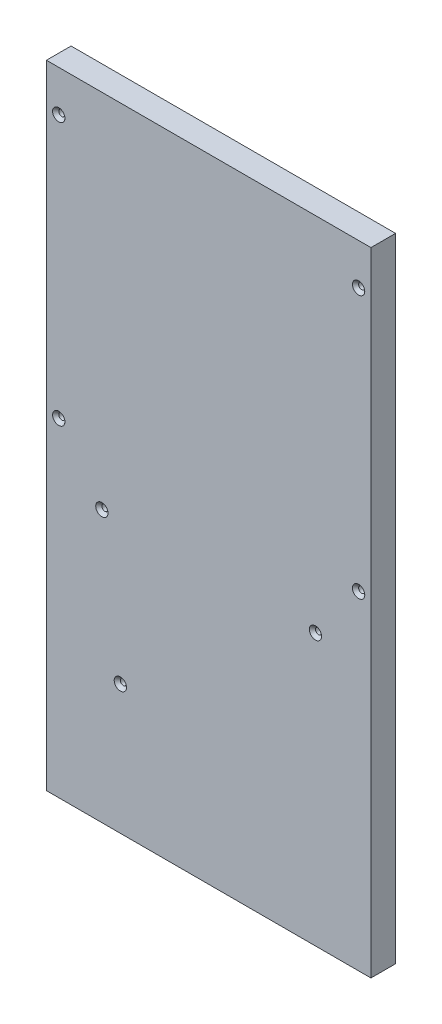
ISO-10303-21;
HEADER;
FILE_DESCRIPTION(('STEP AP214'),'2;1');
FILE_NAME('part.step','',(''),(''),'','','');
FILE_SCHEMA(('AUTOMOTIVE_DESIGN { 1 0 10303 214 1 1 1 1 }'));
ENDSEC;
DATA;
#1=APPLICATION_CONTEXT('core data for automotive mechanical design processes');
#2=APPLICATION_PROTOCOL_DEFINITION('international standard','automotive_design',2000,#1);
#3=PRODUCT_CONTEXT('',#1,'mechanical');
#4=PRODUCT('Part','Part','',(#3));
#5=PRODUCT_RELATED_PRODUCT_CATEGORY('part','',(#4));
#6=PRODUCT_DEFINITION_FORMATION('','',#4);
#7=PRODUCT_DEFINITION_CONTEXT('part definition',#1,'design');
#8=PRODUCT_DEFINITION('design','',#6,#7);
#9=PRODUCT_DEFINITION_SHAPE('','',#8);
#10=(LENGTH_UNIT() NAMED_UNIT(*) SI_UNIT(.MILLI.,.METRE.));
#11=(NAMED_UNIT(*) PLANE_ANGLE_UNIT() SI_UNIT($,.RADIAN.));
#12=(NAMED_UNIT(*) SI_UNIT($,.STERADIAN.) SOLID_ANGLE_UNIT());
#13=UNCERTAINTY_MEASURE_WITH_UNIT(LENGTH_MEASURE(1.E-05),#10,'distance_accuracy_value','');
#14=(GEOMETRIC_REPRESENTATION_CONTEXT(3) GLOBAL_UNCERTAINTY_ASSIGNED_CONTEXT((#13)) GLOBAL_UNIT_ASSIGNED_CONTEXT((#10,
#11,#12)) REPRESENTATION_CONTEXT('',''));
#15=CARTESIAN_POINT('',(0.,0.,0.));
#16=DIRECTION('',(0.,0.,1.));
#17=DIRECTION('',(1.,0.,0.));
#18=AXIS2_PLACEMENT_3D('',#15,#16,#17);
#19=CARTESIAN_POINT('',(0.,0.,12.));
#20=DIRECTION('',(0.,0.,1.));
#21=DIRECTION('',(1.,0.,0.));
#22=AXIS2_PLACEMENT_3D('',#19,#20,#21);
#23=PLANE('',#22);
#24=CARTESIAN_POINT('',(-12.9512195121951,-36.4634146341464,12.));
#25=DIRECTION('',(0.,0.,1.));
#26=DIRECTION('',(1.,0.,0.));
#27=AXIS2_PLACEMENT_3D('',#24,#25,#26);
#28=CIRCLE('',#27,3.);
#29=CARTESIAN_POINT('',(-9.95121951219509,-36.4634146341464,12.));
#30=VERTEX_POINT('',#29);
#31=EDGE_CURVE('E452',#30,#30,#28,.T.);
#32=ORIENTED_EDGE('',*,*,#31,.F.);
#33=EDGE_LOOP('',(#32));
#34=FACE_BOUND('',#33,.T.);
#35=CARTESIAN_POINT('',(-12.9512195121951,91.5365853658536,12.));
#36=DIRECTION('',(0.,0.,1.));
#37=DIRECTION('',(1.,0.,0.));
#38=AXIS2_PLACEMENT_3D('',#35,#36,#37);
#39=CIRCLE('',#38,3.);
#40=CARTESIAN_POINT('',(-9.95121951219511,91.5365853658536,12.));
#41=VERTEX_POINT('',#40);
#42=EDGE_CURVE('E456',#41,#41,#39,.T.);
#43=ORIENTED_EDGE('',*,*,#42,.F.);
#44=EDGE_LOOP('',(#43));
#45=FACE_BOUND('',#44,.T.);
#46=CARTESIAN_POINT('',(-158.951219512195,-36.4634146341464,12.));
#47=DIRECTION('',(0.,0.,1.));
#48=DIRECTION('',(1.,0.,0.));
#49=AXIS2_PLACEMENT_3D('',#46,#47,#48);
#50=CIRCLE('',#49,2.99999999999999);
#51=CARTESIAN_POINT('',(-155.951219512195,-36.4634146341464,12.));
#52=VERTEX_POINT('',#51);
#53=EDGE_CURVE('E461',#52,#52,#50,.T.);
#54=ORIENTED_EDGE('',*,*,#53,.F.);
#55=EDGE_LOOP('',(#54));
#56=FACE_BOUND('',#55,.T.);
#57=CARTESIAN_POINT('',(-158.951219512195,91.5365853658536,12.));
#58=DIRECTION('',(0.,0.,1.));
#59=DIRECTION('',(1.,0.,0.));
#60=AXIS2_PLACEMENT_3D('',#57,#58,#59);
#61=CIRCLE('',#60,2.99999999999999);
#62=CARTESIAN_POINT('',(-155.951219512195,91.5365853658536,12.));
#63=VERTEX_POINT('',#62);
#64=EDGE_CURVE('E139',#63,#63,#61,.T.);
#65=ORIENTED_EDGE('',*,*,#64,.F.);
#66=EDGE_LOOP('',(#65));
#67=FACE_BOUND('',#66,.T.);
#68=CARTESIAN_POINT('',(-128.951219512195,-133.463414634146,12.));
#69=DIRECTION('',(0.,0.,1.));
#70=DIRECTION('',(1.,0.,0.));
#71=AXIS2_PLACEMENT_3D('',#68,#69,#70);
#72=CIRCLE('',#71,2.99999999999999);
#73=CARTESIAN_POINT('',(-125.951219512195,-133.463414634146,12.));
#74=VERTEX_POINT('',#73);
#75=EDGE_CURVE('E467',#74,#74,#72,.T.);
#76=ORIENTED_EDGE('',*,*,#75,.F.);
#77=EDGE_LOOP('',(#76));
#78=FACE_BOUND('',#77,.T.);
#79=CARTESIAN_POINT('',(-33.9512195121951,-64.4634146341464,12.));
#80=DIRECTION('',(0.,0.,1.));
#81=DIRECTION('',(1.,0.,0.));
#82=AXIS2_PLACEMENT_3D('',#79,#80,#81);
#83=CIRCLE('',#82,2.99999999999999);
#84=CARTESIAN_POINT('',(-30.9512195121951,-64.4634146341464,12.));
#85=VERTEX_POINT('',#84);
#86=EDGE_CURVE('E118',#85,#85,#83,.T.);
#87=ORIENTED_EDGE('',*,*,#86,.F.);
#88=EDGE_LOOP('',(#87));
#89=FACE_BOUND('',#88,.T.);
#90=CARTESIAN_POINT('',(-137.951219512195,-64.4634146341464,12.));
#91=DIRECTION('',(0.,0.,1.));
#92=DIRECTION('',(1.,0.,0.));
#93=AXIS2_PLACEMENT_3D('',#90,#91,#92);
#94=CIRCLE('',#93,2.99999999999999);
#95=CARTESIAN_POINT('',(-134.951219512195,-64.4634146341464,12.));
#96=VERTEX_POINT('',#95);
#97=EDGE_CURVE('E113',#96,#96,#94,.T.);
#98=ORIENTED_EDGE('',*,*,#97,.F.);
#99=EDGE_LOOP('',(#98));
#100=FACE_BOUND('',#99,.T.);
#101=DIRECTION('',(0.,-1.,0.));
#102=VECTOR('',#101,1.);
#103=CARTESIAN_POINT('',(-164.951219512195,111.536585365854,12.));
#104=LINE('',#103,#102);
#105=CARTESIAN_POINT('',(-164.951219512195,111.536585365854,12.));
#106=VERTEX_POINT('',#105);
#107=CARTESIAN_POINT('',(-164.951219512195,-196.463414634146,12.));
#108=VERTEX_POINT('',#107);
#109=EDGE_CURVE('E87',#106,#108,#104,.T.);
#110=ORIENTED_EDGE('',*,*,#109,.T.);
#111=DIRECTION('',(1.,0.,0.));
#112=VECTOR('',#111,1.);
#113=CARTESIAN_POINT('',(-164.951219512195,-196.463414634146,12.));
#114=LINE('',#113,#112);
#115=CARTESIAN_POINT('',(-6.95121951219504,-196.463414634146,12.));
#116=VERTEX_POINT('',#115);
#117=EDGE_CURVE('E83',#108,#116,#114,.T.);
#118=ORIENTED_EDGE('',*,*,#117,.T.);
#119=DIRECTION('',(0.,1.,0.));
#120=VECTOR('',#119,1.);
#121=CARTESIAN_POINT('',(-6.95121951219507,111.536585365854,12.));
#122=LINE('',#121,#120);
#123=CARTESIAN_POINT('',(-6.95121951219507,111.536585365854,12.));
#124=VERTEX_POINT('',#123);
#125=EDGE_CURVE('E85',#116,#124,#122,.T.);
#126=ORIENTED_EDGE('',*,*,#125,.T.);
#127=DIRECTION('',(-1.,0.,0.));
#128=VECTOR('',#127,1.);
#129=CARTESIAN_POINT('',(-164.951219512195,111.536585365854,12.));
#130=LINE('',#129,#128);
#131=EDGE_CURVE('E53',#124,#106,#130,.T.);
#132=ORIENTED_EDGE('',*,*,#131,.T.);
#133=EDGE_LOOP('',(#110,#118,#126,#132));
#134=FACE_BOUND('',#133,.T.);
#135=ADVANCED_FACE('F34',(#34,#45,#56,#67,#78,#89,#100,#134),#23,.T.);
#136=CARTESIAN_POINT('',(0.,0.,0.));
#137=DIRECTION('',(0.,0.,1.));
#138=DIRECTION('',(1.,0.,0.));
#139=AXIS2_PLACEMENT_3D('',#136,#137,#138);
#140=PLANE('',#139);
#141=CARTESIAN_POINT('',(-45.9512195121951,-31.4634146341464,0.));
#142=DIRECTION('',(0.,0.,1.));
#143=DIRECTION('',(1.,0.,0.));
#144=AXIS2_PLACEMENT_3D('',#141,#142,#143);
#145=CIRCLE('',#144,7.);
#146=CARTESIAN_POINT('',(-38.9512195121951,-31.4634146341464,0.));
#147=VERTEX_POINT('',#146);
#148=EDGE_CURVE('E453',#147,#147,#145,.T.);
#149=ORIENTED_EDGE('',*,*,#148,.T.);
#150=EDGE_LOOP('',(#149));
#151=FACE_BOUND('',#150,.T.);
#152=DIRECTION('',(0.,-1.,0.));
#153=VECTOR('',#152,1.);
#154=CARTESIAN_POINT('',(-164.951219512195,111.536585365854,0.));
#155=LINE('',#154,#153);
#156=CARTESIAN_POINT('',(-164.951219512195,111.536585365854,0.));
#157=VERTEX_POINT('',#156);
#158=CARTESIAN_POINT('',(-164.951219512195,-196.463414634146,0.));
#159=VERTEX_POINT('',#158);
#160=EDGE_CURVE('E100',#157,#159,#155,.T.);
#161=ORIENTED_EDGE('',*,*,#160,.F.);
#162=DIRECTION('',(-1.,0.,0.));
#163=VECTOR('',#162,1.);
#164=CARTESIAN_POINT('',(-164.951219512195,111.536585365854,0.));
#165=LINE('',#164,#163);
#166=CARTESIAN_POINT('',(-6.95121951219507,111.536585365854,0.));
#167=VERTEX_POINT('',#166);
#168=EDGE_CURVE('E76',#167,#157,#165,.T.);
#169=ORIENTED_EDGE('',*,*,#168,.F.);
#170=DIRECTION('',(0.,1.,0.));
#171=VECTOR('',#170,1.);
#172=CARTESIAN_POINT('',(-6.95121951219507,111.536585365854,0.));
#173=LINE('',#172,#171);
#174=CARTESIAN_POINT('',(-6.95121951219504,-196.463414634146,0.));
#175=VERTEX_POINT('',#174);
#176=EDGE_CURVE('E70',#175,#167,#173,.T.);
#177=ORIENTED_EDGE('',*,*,#176,.F.);
#178=DIRECTION('',(1.,0.,0.));
#179=VECTOR('',#178,1.);
#180=CARTESIAN_POINT('',(-164.951219512195,-196.463414634146,0.));
#181=LINE('',#180,#179);
#182=EDGE_CURVE('E91',#159,#175,#181,.T.);
#183=ORIENTED_EDGE('',*,*,#182,.F.);
#184=EDGE_LOOP('',(#161,#169,#177,#183));
#185=FACE_BOUND('',#184,.T.);
#186=CARTESIAN_POINT('',(-137.951219512195,-64.4634146341464,0.));
#187=DIRECTION('',(0.,0.,1.));
#188=DIRECTION('',(1.,0.,0.));
#189=AXIS2_PLACEMENT_3D('',#186,#187,#188);
#190=CIRCLE('',#189,1.5);
#191=CARTESIAN_POINT('',(-136.451219512195,-64.4634146341464,0.));
#192=VERTEX_POINT('',#191);
#193=EDGE_CURVE('E103',#192,#192,#190,.T.);
#194=ORIENTED_EDGE('',*,*,#193,.T.);
#195=EDGE_LOOP('',(#194));
#196=FACE_BOUND('',#195,.T.);
#197=CARTESIAN_POINT('',(-33.9512195121951,-64.4634146341464,0.));
#198=DIRECTION('',(0.,0.,1.));
#199=DIRECTION('',(1.,0.,0.));
#200=AXIS2_PLACEMENT_3D('',#197,#198,#199);
#201=CIRCLE('',#200,1.5);
#202=CARTESIAN_POINT('',(-32.4512195121951,-64.4634146341464,0.));
#203=VERTEX_POINT('',#202);
#204=EDGE_CURVE('E167',#203,#203,#201,.T.);
#205=ORIENTED_EDGE('',*,*,#204,.T.);
#206=EDGE_LOOP('',(#205));
#207=FACE_BOUND('',#206,.T.);
#208=CARTESIAN_POINT('',(-128.951219512195,-133.463414634146,0.));
#209=DIRECTION('',(0.,0.,1.));
#210=DIRECTION('',(1.,0.,0.));
#211=AXIS2_PLACEMENT_3D('',#208,#209,#210);
#212=CIRCLE('',#211,1.5);
#213=CARTESIAN_POINT('',(-127.451219512195,-133.463414634146,0.));
#214=VERTEX_POINT('',#213);
#215=EDGE_CURVE('E164',#214,#214,#212,.T.);
#216=ORIENTED_EDGE('',*,*,#215,.T.);
#217=EDGE_LOOP('',(#216));
#218=FACE_BOUND('',#217,.T.);
#219=CARTESIAN_POINT('',(-158.951219512195,91.5365853658536,0.));
#220=DIRECTION('',(0.,0.,1.));
#221=DIRECTION('',(1.,0.,0.));
#222=AXIS2_PLACEMENT_3D('',#219,#220,#221);
#223=CIRCLE('',#222,1.5);
#224=CARTESIAN_POINT('',(-157.451219512195,91.5365853658536,0.));
#225=VERTEX_POINT('',#224);
#226=EDGE_CURVE('E161',#225,#225,#223,.T.);
#227=ORIENTED_EDGE('',*,*,#226,.T.);
#228=EDGE_LOOP('',(#227));
#229=FACE_BOUND('',#228,.T.);
#230=CARTESIAN_POINT('',(-158.951219512195,-36.4634146341464,0.));
#231=DIRECTION('',(0.,0.,1.));
#232=DIRECTION('',(1.,0.,0.));
#233=AXIS2_PLACEMENT_3D('',#230,#231,#232);
#234=CIRCLE('',#233,1.5);
#235=CARTESIAN_POINT('',(-157.451219512195,-36.4634146341464,0.));
#236=VERTEX_POINT('',#235);
#237=EDGE_CURVE('E158',#236,#236,#234,.T.);
#238=ORIENTED_EDGE('',*,*,#237,.T.);
#239=EDGE_LOOP('',(#238));
#240=FACE_BOUND('',#239,.T.);
#241=CARTESIAN_POINT('',(-12.9512195121951,91.5365853658536,0.));
#242=DIRECTION('',(0.,0.,1.));
#243=DIRECTION('',(1.,0.,0.));
#244=AXIS2_PLACEMENT_3D('',#241,#242,#243);
#245=CIRCLE('',#244,1.5);
#246=CARTESIAN_POINT('',(-11.4512195121951,91.5365853658536,0.));
#247=VERTEX_POINT('',#246);
#248=EDGE_CURVE('E155',#247,#247,#245,.T.);
#249=ORIENTED_EDGE('',*,*,#248,.T.);
#250=EDGE_LOOP('',(#249));
#251=FACE_BOUND('',#250,.T.);
#252=CARTESIAN_POINT('',(-12.9512195121951,-36.4634146341464,0.));
#253=DIRECTION('',(0.,0.,1.));
#254=DIRECTION('',(1.,0.,0.));
#255=AXIS2_PLACEMENT_3D('',#252,#253,#254);
#256=CIRCLE('',#255,1.5);
#257=CARTESIAN_POINT('',(-11.4512195121951,-36.4634146341464,0.));
#258=VERTEX_POINT('',#257);
#259=EDGE_CURVE('E150',#258,#258,#256,.T.);
#260=ORIENTED_EDGE('',*,*,#259,.T.);
#261=EDGE_LOOP('',(#260));
#262=FACE_BOUND('',#261,.T.);
#263=ADVANCED_FACE('F173',(#151,#185,#196,#207,#218,#229,#240,#251,#262),#140,.F.);
#264=CARTESIAN_POINT('',(-164.951219512195,111.536585365854,12.));
#265=DIRECTION('',(1.,0.,0.));
#266=DIRECTION('',(0.,1.,0.));
#267=AXIS2_PLACEMENT_3D('',#264,#265,#266);
#268=PLANE('',#267);
#269=ORIENTED_EDGE('',*,*,#160,.T.);
#270=DIRECTION('',(0.,0.,-1.));
#271=VECTOR('',#270,1.);
#272=CARTESIAN_POINT('',(-164.951219512195,-196.463414634146,12.));
#273=LINE('',#272,#271);
#274=EDGE_CURVE('E11',#108,#159,#273,.T.);
#275=ORIENTED_EDGE('',*,*,#274,.F.);
#276=ORIENTED_EDGE('',*,*,#109,.F.);
#277=DIRECTION('',(0.,0.,-1.));
#278=VECTOR('',#277,1.);
#279=CARTESIAN_POINT('',(-164.951219512195,111.536585365854,12.));
#280=LINE('',#279,#278);
#281=EDGE_CURVE('E96',#106,#157,#280,.T.);
#282=ORIENTED_EDGE('',*,*,#281,.T.);
#283=EDGE_LOOP('',(#269,#275,#276,#282));
#284=FACE_BOUND('',#283,.T.);
#285=ADVANCED_FACE('F36',(#284),#268,.F.);
#286=CARTESIAN_POINT('',(-164.951219512195,-196.463414634146,12.));
#287=DIRECTION('',(0.,1.,0.));
#288=DIRECTION('',(0.,0.,1.));
#289=AXIS2_PLACEMENT_3D('',#286,#287,#288);
#290=PLANE('',#289);
#291=CARTESIAN_POINT('',(-21.9512195121951,-196.463414634146,6.00000000000002));
#292=DIRECTION('',(0.,1.,0.));
#293=DIRECTION('',(0.,0.,1.));
#294=AXIS2_PLACEMENT_3D('',#291,#292,#293);
#295=CIRCLE('',#294,1.5);
#296=CARTESIAN_POINT('',(-21.9512195121951,-196.463414634146,7.50000000000002));
#297=VERTEX_POINT('',#296);
#298=EDGE_CURVE('E112',#297,#297,#295,.T.);
#299=ORIENTED_EDGE('',*,*,#298,.T.);
#300=EDGE_LOOP('',(#299));
#301=FACE_BOUND('',#300,.T.);
#302=CARTESIAN_POINT('',(-149.951219512195,-196.463414634146,6.00000000000002));
#303=DIRECTION('',(0.,1.,0.));
#304=DIRECTION('',(0.,0.,1.));
#305=AXIS2_PLACEMENT_3D('',#302,#303,#304);
#306=CIRCLE('',#305,1.5);
#307=CARTESIAN_POINT('',(-149.951219512195,-196.463414634146,7.50000000000002));
#308=VERTEX_POINT('',#307);
#309=EDGE_CURVE('E144',#308,#308,#306,.T.);
#310=ORIENTED_EDGE('',*,*,#309,.T.);
#311=EDGE_LOOP('',(#310));
#312=FACE_BOUND('',#311,.T.);
#313=ORIENTED_EDGE('',*,*,#182,.T.);
#314=DIRECTION('',(0.,0.,-1.));
#315=VECTOR('',#314,1.);
#316=CARTESIAN_POINT('',(-6.95121951219504,-196.463414634146,12.));
#317=LINE('',#316,#315);
#318=EDGE_CURVE('E44',#116,#175,#317,.T.);
#319=ORIENTED_EDGE('',*,*,#318,.F.);
#320=ORIENTED_EDGE('',*,*,#117,.F.);
#321=ORIENTED_EDGE('',*,*,#274,.T.);
#322=EDGE_LOOP('',(#313,#319,#320,#321));
#323=FACE_BOUND('',#322,.T.);
#324=ADVANCED_FACE('F90',(#301,#312,#323),#290,.F.);
#325=CARTESIAN_POINT('',(-6.95121951219507,111.536585365854,12.));
#326=DIRECTION('',(-1.,0.,0.));
#327=DIRECTION('',(0.,-1.,0.));
#328=AXIS2_PLACEMENT_3D('',#325,#326,#327);
#329=PLANE('',#328);
#330=ORIENTED_EDGE('',*,*,#176,.T.);
#331=DIRECTION('',(0.,0.,-1.));
#332=VECTOR('',#331,1.);
#333=CARTESIAN_POINT('',(-6.95121951219507,111.536585365854,12.));
#334=LINE('',#333,#332);
#335=EDGE_CURVE('E92',#124,#167,#334,.T.);
#336=ORIENTED_EDGE('',*,*,#335,.F.);
#337=ORIENTED_EDGE('',*,*,#125,.F.);
#338=ORIENTED_EDGE('',*,*,#318,.T.);
#339=EDGE_LOOP('',(#330,#336,#337,#338));
#340=FACE_BOUND('',#339,.T.);
#341=ADVANCED_FACE('F94',(#340),#329,.F.);
#342=CARTESIAN_POINT('',(-164.951219512195,111.536585365854,12.));
#343=DIRECTION('',(0.,-1.,0.));
#344=DIRECTION('',(0.,0.,-1.));
#345=AXIS2_PLACEMENT_3D('',#342,#343,#344);
#346=PLANE('',#345);
#347=ORIENTED_EDGE('',*,*,#168,.T.);
#348=ORIENTED_EDGE('',*,*,#281,.F.);
#349=ORIENTED_EDGE('',*,*,#131,.F.);
#350=ORIENTED_EDGE('',*,*,#335,.T.);
#351=EDGE_LOOP('',(#347,#348,#349,#350));
#352=FACE_BOUND('',#351,.T.);
#353=ADVANCED_FACE('F179',(#352),#346,.F.);
#354=CARTESIAN_POINT('',(-137.951219512195,-64.4634146341464,12.));
#355=DIRECTION('',(0.,0.,-1.));
#356=DIRECTION('',(-1.,0.,0.));
#357=AXIS2_PLACEMENT_3D('',#354,#355,#356);
#358=CYLINDRICAL_SURFACE('',#357,1.5);
#359=CARTESIAN_POINT('',(-137.951219512195,-64.4634146341464,10.5));
#360=DIRECTION('',(0.,0.,1.));
#361=DIRECTION('',(1.,0.,0.));
#362=AXIS2_PLACEMENT_3D('',#359,#360,#361);
#363=CIRCLE('',#362,1.5);
#364=CARTESIAN_POINT('',(-136.451219512195,-64.4634146341464,10.5));
#365=VERTEX_POINT('',#364);
#366=EDGE_CURVE('E109',#365,#365,#363,.F.);
#367=ORIENTED_EDGE('',*,*,#366,.F.);
#368=EDGE_LOOP('',(#367));
#369=FACE_BOUND('',#368,.T.);
#370=ORIENTED_EDGE('',*,*,#193,.F.);
#371=EDGE_LOOP('',(#370));
#372=FACE_BOUND('',#371,.T.);
#373=ADVANCED_FACE('F176',(#369,#372),#358,.F.);
#374=CARTESIAN_POINT('',(-33.9512195121951,-64.4634146341464,12.));
#375=DIRECTION('',(0.,0.,-1.));
#376=DIRECTION('',(-1.,0.,0.));
#377=AXIS2_PLACEMENT_3D('',#374,#375,#376);
#378=CYLINDRICAL_SURFACE('',#377,1.5);
#379=CARTESIAN_POINT('',(-33.9512195121951,-64.4634146341464,10.5));
#380=DIRECTION('',(0.,0.,1.));
#381=DIRECTION('',(1.,0.,0.));
#382=AXIS2_PLACEMENT_3D('',#379,#380,#381);
#383=CIRCLE('',#382,1.5);
#384=CARTESIAN_POINT('',(-32.4512195121951,-64.4634146341464,10.5));
#385=VERTEX_POINT('',#384);
#386=EDGE_CURVE('E38',#385,#385,#383,.F.);
#387=ORIENTED_EDGE('',*,*,#386,.F.);
#388=EDGE_LOOP('',(#387));
#389=FACE_BOUND('',#388,.T.);
#390=ORIENTED_EDGE('',*,*,#204,.F.);
#391=EDGE_LOOP('',(#390));
#392=FACE_BOUND('',#391,.T.);
#393=ADVANCED_FACE('F178',(#389,#392),#378,.F.);
#394=CARTESIAN_POINT('',(-128.951219512195,-133.463414634146,12.));
#395=DIRECTION('',(0.,0.,-1.));
#396=DIRECTION('',(-1.,0.,0.));
#397=AXIS2_PLACEMENT_3D('',#394,#395,#396);
#398=CYLINDRICAL_SURFACE('',#397,1.5);
#399=CARTESIAN_POINT('',(-128.951219512195,-133.463414634146,10.5));
#400=DIRECTION('',(0.,0.,1.));
#401=DIRECTION('',(1.,0.,0.));
#402=AXIS2_PLACEMENT_3D('',#399,#400,#401);
#403=CIRCLE('',#402,1.5);
#404=CARTESIAN_POINT('',(-127.451219512195,-133.463414634146,10.5));
#405=VERTEX_POINT('',#404);
#406=EDGE_CURVE('E126',#405,#405,#403,.F.);
#407=ORIENTED_EDGE('',*,*,#406,.F.);
#408=EDGE_LOOP('',(#407));
#409=FACE_BOUND('',#408,.T.);
#410=ORIENTED_EDGE('',*,*,#215,.F.);
#411=EDGE_LOOP('',(#410));
#412=FACE_BOUND('',#411,.T.);
#413=ADVANCED_FACE('F186',(#409,#412),#398,.F.);
#414=CARTESIAN_POINT('',(-158.951219512195,91.5365853658536,12.));
#415=DIRECTION('',(0.,0.,-1.));
#416=DIRECTION('',(-1.,0.,0.));
#417=AXIS2_PLACEMENT_3D('',#414,#415,#416);
#418=CYLINDRICAL_SURFACE('',#417,1.5);
#419=CARTESIAN_POINT('',(-158.951219512195,91.5365853658536,10.5));
#420=DIRECTION('',(0.,0.,1.));
#421=DIRECTION('',(1.,0.,0.));
#422=AXIS2_PLACEMENT_3D('',#419,#420,#421);
#423=CIRCLE('',#422,1.5);
#424=CARTESIAN_POINT('',(-157.451219512195,91.5365853658536,10.5));
#425=VERTEX_POINT('',#424);
#426=EDGE_CURVE('E124',#425,#425,#423,.F.);
#427=ORIENTED_EDGE('',*,*,#426,.F.);
#428=EDGE_LOOP('',(#427));
#429=FACE_BOUND('',#428,.T.);
#430=ORIENTED_EDGE('',*,*,#226,.F.);
#431=EDGE_LOOP('',(#430));
#432=FACE_BOUND('',#431,.T.);
#433=ADVANCED_FACE('F237',(#429,#432),#418,.F.);
#434=CARTESIAN_POINT('',(-158.951219512195,-36.4634146341464,12.));
#435=DIRECTION('',(0.,0.,-1.));
#436=DIRECTION('',(-1.,0.,0.));
#437=AXIS2_PLACEMENT_3D('',#434,#435,#436);
#438=CYLINDRICAL_SURFACE('',#437,1.5);
#439=CARTESIAN_POINT('',(-158.951219512195,-36.4634146341464,10.5));
#440=DIRECTION('',(0.,0.,1.));
#441=DIRECTION('',(1.,0.,0.));
#442=AXIS2_PLACEMENT_3D('',#439,#440,#441);
#443=CIRCLE('',#442,1.5);
#444=CARTESIAN_POINT('',(-157.451219512195,-36.4634146341464,10.5));
#445=VERTEX_POINT('',#444);
#446=EDGE_CURVE('E121',#445,#445,#443,.F.);
#447=ORIENTED_EDGE('',*,*,#446,.F.);
#448=EDGE_LOOP('',(#447));
#449=FACE_BOUND('',#448,.T.);
#450=ORIENTED_EDGE('',*,*,#237,.F.);
#451=EDGE_LOOP('',(#450));
#452=FACE_BOUND('',#451,.T.);
#453=ADVANCED_FACE('F233',(#449,#452),#438,.F.);
#454=CARTESIAN_POINT('',(-12.9512195121951,91.5365853658536,12.));
#455=DIRECTION('',(0.,0.,-1.));
#456=DIRECTION('',(-1.,0.,0.));
#457=AXIS2_PLACEMENT_3D('',#454,#455,#456);
#458=CYLINDRICAL_SURFACE('',#457,1.5);
#459=CARTESIAN_POINT('',(-12.9512195121951,91.5365853658536,10.5));
#460=DIRECTION('',(0.,0.,1.));
#461=DIRECTION('',(1.,0.,0.));
#462=AXIS2_PLACEMENT_3D('',#459,#460,#461);
#463=CIRCLE('',#462,1.5);
#464=CARTESIAN_POINT('',(-11.4512195121951,91.5365853658536,10.5));
#465=VERTEX_POINT('',#464);
#466=EDGE_CURVE('E117',#465,#465,#463,.F.);
#467=ORIENTED_EDGE('',*,*,#466,.F.);
#468=EDGE_LOOP('',(#467));
#469=FACE_BOUND('',#468,.T.);
#470=ORIENTED_EDGE('',*,*,#248,.F.);
#471=EDGE_LOOP('',(#470));
#472=FACE_BOUND('',#471,.T.);
#473=ADVANCED_FACE('F226',(#469,#472),#458,.F.);
#474=CARTESIAN_POINT('',(-12.9512195121951,-36.4634146341464,12.));
#475=DIRECTION('',(0.,0.,-1.));
#476=DIRECTION('',(-1.,0.,0.));
#477=AXIS2_PLACEMENT_3D('',#474,#475,#476);
#478=CYLINDRICAL_SURFACE('',#477,1.5);
#479=CARTESIAN_POINT('',(-12.9512195121951,-36.4634146341464,10.5));
#480=DIRECTION('',(0.,0.,1.));
#481=DIRECTION('',(1.,0.,0.));
#482=AXIS2_PLACEMENT_3D('',#479,#480,#481);
#483=CIRCLE('',#482,1.5);
#484=CARTESIAN_POINT('',(-11.4512195121951,-36.4634146341464,10.5));
#485=VERTEX_POINT('',#484);
#486=EDGE_CURVE('E114',#485,#485,#483,.F.);
#487=ORIENTED_EDGE('',*,*,#486,.F.);
#488=EDGE_LOOP('',(#487));
#489=FACE_BOUND('',#488,.T.);
#490=ORIENTED_EDGE('',*,*,#259,.F.);
#491=EDGE_LOOP('',(#490));
#492=FACE_BOUND('',#491,.T.);
#493=ADVANCED_FACE('F216',(#489,#492),#478,.F.);
#494=CARTESIAN_POINT('',(-149.951219512195,-176.463414634146,6.00000000000002));
#495=DIRECTION('',(0.,-1.,0.));
#496=DIRECTION('',(0.,0.,-1.));
#497=AXIS2_PLACEMENT_3D('',#494,#495,#496);
#498=CYLINDRICAL_SURFACE('',#497,1.5);
#499=CARTESIAN_POINT('',(-149.951219512195,-176.463414634146,6.00000000000002));
#500=DIRECTION('',(0.,1.,0.));
#501=DIRECTION('',(0.,0.,1.));
#502=AXIS2_PLACEMENT_3D('',#499,#500,#501);
#503=CIRCLE('',#502,1.5);
#504=CARTESIAN_POINT('',(-149.951219512195,-176.463414634146,7.50000000000002));
#505=VERTEX_POINT('',#504);
#506=EDGE_CURVE('E147',#505,#505,#503,.T.);
#507=ORIENTED_EDGE('',*,*,#506,.T.);
#508=EDGE_LOOP('',(#507));
#509=FACE_BOUND('',#508,.T.);
#510=ORIENTED_EDGE('',*,*,#309,.F.);
#511=EDGE_LOOP('',(#510));
#512=FACE_BOUND('',#511,.T.);
#513=ADVANCED_FACE('F213',(#509,#512),#498,.F.);
#514=CARTESIAN_POINT('',(-149.951219512195,-176.463414634146,6.00000000000002));
#515=DIRECTION('',(0.,1.,0.));
#516=DIRECTION('',(0.,0.,1.));
#517=AXIS2_PLACEMENT_3D('',#514,#515,#516);
#518=PLANE('',#517);
#519=ORIENTED_EDGE('',*,*,#506,.F.);
#520=EDGE_LOOP('',(#519));
#521=FACE_BOUND('',#520,.T.);
#522=ADVANCED_FACE('F215',(#521),#518,.F.);
#523=CARTESIAN_POINT('',(-21.9512195121951,-176.463414634146,6.00000000000002));
#524=DIRECTION('',(0.,-1.,0.));
#525=DIRECTION('',(0.,0.,-1.));
#526=AXIS2_PLACEMENT_3D('',#523,#524,#525);
#527=CYLINDRICAL_SURFACE('',#526,1.5);
#528=CARTESIAN_POINT('',(-21.9512195121951,-176.463414634146,6.00000000000002));
#529=DIRECTION('',(0.,1.,0.));
#530=DIRECTION('',(0.,0.,1.));
#531=AXIS2_PLACEMENT_3D('',#528,#529,#530);
#532=CIRCLE('',#531,1.5);
#533=CARTESIAN_POINT('',(-21.9512195121951,-176.463414634146,7.50000000000002));
#534=VERTEX_POINT('',#533);
#535=EDGE_CURVE('E141',#534,#534,#532,.T.);
#536=ORIENTED_EDGE('',*,*,#535,.T.);
#537=EDGE_LOOP('',(#536));
#538=FACE_BOUND('',#537,.T.);
#539=ORIENTED_EDGE('',*,*,#298,.F.);
#540=EDGE_LOOP('',(#539));
#541=FACE_BOUND('',#540,.T.);
#542=ADVANCED_FACE('F223',(#538,#541),#527,.F.);
#543=CARTESIAN_POINT('',(-21.9512195121951,-176.463414634146,6.00000000000002));
#544=DIRECTION('',(0.,1.,0.));
#545=DIRECTION('',(0.,0.,1.));
#546=AXIS2_PLACEMENT_3D('',#543,#544,#545);
#547=PLANE('',#546);
#548=ORIENTED_EDGE('',*,*,#535,.F.);
#549=EDGE_LOOP('',(#548));
#550=FACE_BOUND('',#549,.T.);
#551=ADVANCED_FACE('F291',(#550),#547,.F.);
#552=CARTESIAN_POINT('',(-137.951219512195,-64.4634146341464,12.));
#553=DIRECTION('',(0.,0.,1.));
#554=DIRECTION('',(1.,0.,0.));
#555=AXIS2_PLACEMENT_3D('',#552,#553,#554);
#556=CONICAL_SURFACE('',#555,2.99999999999999,0.78539816339745);
#557=ORIENTED_EDGE('',*,*,#366,.T.);
#558=EDGE_LOOP('',(#557));
#559=FACE_BOUND('',#558,.T.);
#560=ORIENTED_EDGE('',*,*,#97,.T.);
#561=EDGE_LOOP('',(#560));
#562=FACE_BOUND('',#561,.T.);
#563=ADVANCED_FACE('F285',(#559,#562),#556,.F.);
#564=CARTESIAN_POINT('',(-12.9512195121951,-36.4634146341464,12.));
#565=DIRECTION('',(0.,0.,1.));
#566=DIRECTION('',(1.,0.,0.));
#567=AXIS2_PLACEMENT_3D('',#564,#565,#566);
#568=CONICAL_SURFACE('',#567,3.,0.78539816339745);
#569=ORIENTED_EDGE('',*,*,#486,.T.);
#570=EDGE_LOOP('',(#569));
#571=FACE_BOUND('',#570,.T.);
#572=ORIENTED_EDGE('',*,*,#31,.T.);
#573=EDGE_LOOP('',(#572));
#574=FACE_BOUND('',#573,.T.);
#575=ADVANCED_FACE('F290',(#571,#574),#568,.F.);
#576=CARTESIAN_POINT('',(-12.9512195121951,91.5365853658536,12.));
#577=DIRECTION('',(0.,0.,1.));
#578=DIRECTION('',(1.,0.,0.));
#579=AXIS2_PLACEMENT_3D('',#576,#577,#578);
#580=CONICAL_SURFACE('',#579,3.,0.78539816339745);
#581=ORIENTED_EDGE('',*,*,#466,.T.);
#582=EDGE_LOOP('',(#581));
#583=FACE_BOUND('',#582,.T.);
#584=ORIENTED_EDGE('',*,*,#42,.T.);
#585=EDGE_LOOP('',(#584));
#586=FACE_BOUND('',#585,.T.);
#587=ADVANCED_FACE('F303',(#583,#586),#580,.F.);
#588=CARTESIAN_POINT('',(-158.951219512195,-36.4634146341464,12.));
#589=DIRECTION('',(0.,0.,1.));
#590=DIRECTION('',(1.,0.,0.));
#591=AXIS2_PLACEMENT_3D('',#588,#589,#590);
#592=CONICAL_SURFACE('',#591,2.99999999999999,0.78539816339745);
#593=ORIENTED_EDGE('',*,*,#446,.T.);
#594=EDGE_LOOP('',(#593));
#595=FACE_BOUND('',#594,.T.);
#596=ORIENTED_EDGE('',*,*,#53,.T.);
#597=EDGE_LOOP('',(#596));
#598=FACE_BOUND('',#597,.T.);
#599=ADVANCED_FACE('F313',(#595,#598),#592,.F.);
#600=CARTESIAN_POINT('',(-158.951219512195,91.5365853658536,12.));
#601=DIRECTION('',(0.,0.,1.));
#602=DIRECTION('',(1.,0.,0.));
#603=AXIS2_PLACEMENT_3D('',#600,#601,#602);
#604=CONICAL_SURFACE('',#603,2.99999999999999,0.78539816339745);
#605=ORIENTED_EDGE('',*,*,#426,.T.);
#606=EDGE_LOOP('',(#605));
#607=FACE_BOUND('',#606,.T.);
#608=ORIENTED_EDGE('',*,*,#64,.T.);
#609=EDGE_LOOP('',(#608));
#610=FACE_BOUND('',#609,.T.);
#611=ADVANCED_FACE('F323',(#607,#610),#604,.F.);
#612=CARTESIAN_POINT('',(-128.951219512195,-133.463414634146,12.));
#613=DIRECTION('',(0.,0.,1.));
#614=DIRECTION('',(1.,0.,0.));
#615=AXIS2_PLACEMENT_3D('',#612,#613,#614);
#616=CONICAL_SURFACE('',#615,2.99999999999999,0.78539816339745);
#617=ORIENTED_EDGE('',*,*,#406,.T.);
#618=EDGE_LOOP('',(#617));
#619=FACE_BOUND('',#618,.T.);
#620=ORIENTED_EDGE('',*,*,#75,.T.);
#621=EDGE_LOOP('',(#620));
#622=FACE_BOUND('',#621,.T.);
#623=ADVANCED_FACE('F333',(#619,#622),#616,.F.);
#624=CARTESIAN_POINT('',(-33.9512195121951,-64.4634146341464,12.));
#625=DIRECTION('',(0.,0.,1.));
#626=DIRECTION('',(1.,0.,0.));
#627=AXIS2_PLACEMENT_3D('',#624,#625,#626);
#628=CONICAL_SURFACE('',#627,2.99999999999999,0.78539816339745);
#629=ORIENTED_EDGE('',*,*,#386,.T.);
#630=EDGE_LOOP('',(#629));
#631=FACE_BOUND('',#630,.T.);
#632=ORIENTED_EDGE('',*,*,#86,.T.);
#633=EDGE_LOOP('',(#632));
#634=FACE_BOUND('',#633,.T.);
#635=ADVANCED_FACE('F343',(#631,#634),#628,.F.);
#636=CARTESIAN_POINT('',(-45.9512195121951,-31.4634146341464,5.));
#637=DIRECTION('',(0.,0.,-1.));
#638=DIRECTION('',(-1.,0.,0.));
#639=AXIS2_PLACEMENT_3D('',#636,#637,#638);
#640=CYLINDRICAL_SURFACE('',#639,7.);
#641=CARTESIAN_POINT('',(-45.9512195121951,-31.4634146341464,5.));
#642=DIRECTION('',(0.,0.,1.));
#643=DIRECTION('',(1.,0.,0.));
#644=AXIS2_PLACEMENT_3D('',#641,#642,#643);
#645=CIRCLE('',#644,7.);
#646=CARTESIAN_POINT('',(-38.9512195121951,-31.4634146341464,5.));
#647=VERTEX_POINT('',#646);
#648=EDGE_CURVE('E451',#647,#647,#645,.T.);
#649=ORIENTED_EDGE('',*,*,#648,.T.);
#650=EDGE_LOOP('',(#649));
#651=FACE_BOUND('',#650,.T.);
#652=ORIENTED_EDGE('',*,*,#148,.F.);
#653=EDGE_LOOP('',(#652));
#654=FACE_BOUND('',#653,.T.);
#655=ADVANCED_FACE('F352',(#651,#654),#640,.F.);
#656=CARTESIAN_POINT('',(-45.9512195121951,-31.4634146341464,5.));
#657=DIRECTION('',(0.,0.,1.));
#658=DIRECTION('',(1.,0.,0.));
#659=AXIS2_PLACEMENT_3D('',#656,#657,#658);
#660=PLANE('',#659);
#661=ORIENTED_EDGE('',*,*,#648,.F.);
#662=EDGE_LOOP('',(#661));
#663=FACE_BOUND('',#662,.T.);
#664=ADVANCED_FACE('F369',(#663),#660,.F.);
#665=CLOSED_SHELL('',(#135,#263,#285,#324,#341,#353,#373,#393,#413,#433,#453,#473,#493,#513,
#522,#542,#551,#563,#575,#587,#599,#611,#623,#635,#655,#664));
#666=MANIFOLD_SOLID_BREP('B2',#665);
#667=ADVANCED_BREP_SHAPE_REPRESENTATION('',(#18,#666),#14);
#668=SHAPE_DEFINITION_REPRESENTATION(#9,#667);
ENDSEC;
END-ISO-10303-21;
